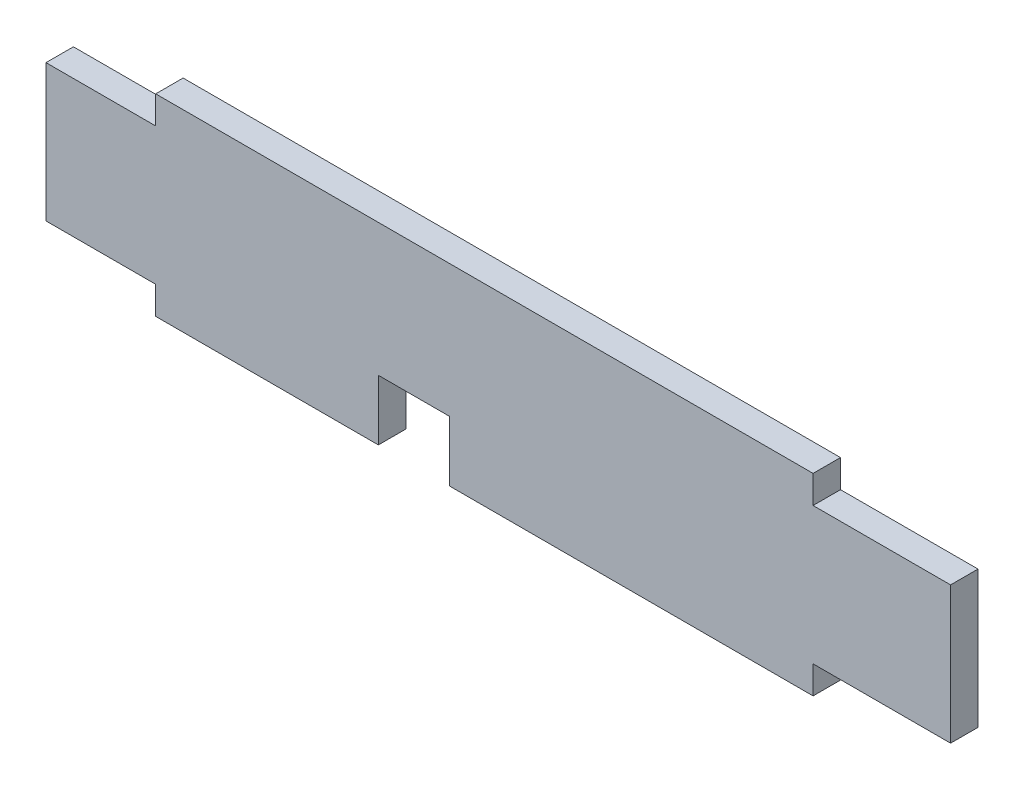
ISO-10303-21;
HEADER;
FILE_DESCRIPTION(('STEP AP214'),'2;1');
FILE_NAME('part.step','',(''),(''),'','','');
FILE_SCHEMA(('AUTOMOTIVE_DESIGN { 1 0 10303 214 1 1 1 1 }'));
ENDSEC;
DATA;
#1=APPLICATION_CONTEXT('core data for automotive mechanical design processes');
#2=APPLICATION_PROTOCOL_DEFINITION('international standard','automotive_design',2000,#1);
#3=PRODUCT_CONTEXT('',#1,'mechanical');
#4=PRODUCT('Part','Part','',(#3));
#5=PRODUCT_RELATED_PRODUCT_CATEGORY('part','',(#4));
#6=PRODUCT_DEFINITION_FORMATION('','',#4);
#7=PRODUCT_DEFINITION_CONTEXT('part definition',#1,'design');
#8=PRODUCT_DEFINITION('design','',#6,#7);
#9=PRODUCT_DEFINITION_SHAPE('','',#8);
#10=(LENGTH_UNIT() NAMED_UNIT(*) SI_UNIT(.MILLI.,.METRE.));
#11=(NAMED_UNIT(*) PLANE_ANGLE_UNIT() SI_UNIT($,.RADIAN.));
#12=(NAMED_UNIT(*) SI_UNIT($,.STERADIAN.) SOLID_ANGLE_UNIT());
#13=UNCERTAINTY_MEASURE_WITH_UNIT(LENGTH_MEASURE(1.E-05),#10,'distance_accuracy_value','');
#14=(GEOMETRIC_REPRESENTATION_CONTEXT(3) GLOBAL_UNCERTAINTY_ASSIGNED_CONTEXT((#13)) GLOBAL_UNIT_ASSIGNED_CONTEXT((#10,
#11,#12)) REPRESENTATION_CONTEXT('',''));
#15=CARTESIAN_POINT('',(0.,0.,0.));
#16=DIRECTION('',(0.,0.,1.));
#17=DIRECTION('',(1.,0.,0.));
#18=AXIS2_PLACEMENT_3D('',#15,#16,#17);
#19=CARTESIAN_POINT('',(0.,0.,5.));
#20=DIRECTION('',(0.,1.,0.));
#21=DIRECTION('',(0.,0.,1.));
#22=AXIS2_PLACEMENT_3D('',#19,#20,#21);
#23=PLANE('',#22);
#24=DIRECTION('',(1.,0.,0.));
#25=VECTOR('',#24,1.);
#26=CARTESIAN_POINT('',(0.,0.,0.));
#27=LINE('',#26,#25);
#28=CARTESIAN_POINT('',(0.,0.,0.));
#29=VERTEX_POINT('',#28);
#30=CARTESIAN_POINT('',(20.,0.,0.));
#31=VERTEX_POINT('',#30);
#32=EDGE_CURVE('E254',#29,#31,#27,.T.);
#33=ORIENTED_EDGE('',*,*,#32,.T.);
#34=DIRECTION('',(0.,0.,-1.));
#35=VECTOR('',#34,1.);
#36=CARTESIAN_POINT('',(20.,0.,5.));
#37=LINE('',#36,#35);
#38=CARTESIAN_POINT('',(20.,0.,5.));
#39=VERTEX_POINT('',#38);
#40=EDGE_CURVE('E11',#39,#31,#37,.T.);
#41=ORIENTED_EDGE('',*,*,#40,.F.);
#42=DIRECTION('',(1.,0.,0.));
#43=VECTOR('',#42,1.);
#44=CARTESIAN_POINT('',(0.,0.,5.));
#45=LINE('',#44,#43);
#46=CARTESIAN_POINT('',(0.,0.,5.));
#47=VERTEX_POINT('',#46);
#48=EDGE_CURVE('E193',#47,#39,#45,.T.);
#49=ORIENTED_EDGE('',*,*,#48,.F.);
#50=DIRECTION('',(0.,0.,-1.));
#51=VECTOR('',#50,1.);
#52=CARTESIAN_POINT('',(0.,0.,5.));
#53=LINE('',#52,#51);
#54=EDGE_CURVE('E54',#47,#29,#53,.T.);
#55=ORIENTED_EDGE('',*,*,#54,.T.);
#56=EDGE_LOOP('',(#33,#41,#49,#55));
#57=FACE_BOUND('',#56,.T.);
#58=ADVANCED_FACE('F37',(#57),#23,.F.);
#59=CARTESIAN_POINT('',(20.,0.,5.));
#60=DIRECTION('',(1.,0.,0.));
#61=DIRECTION('',(0.,0.,-1.));
#62=AXIS2_PLACEMENT_3D('',#59,#60,#61);
#63=PLANE('',#62);
#64=DIRECTION('',(0.,-1.,0.));
#65=VECTOR('',#64,1.);
#66=CARTESIAN_POINT('',(20.,0.,0.));
#67=LINE('',#66,#65);
#68=CARTESIAN_POINT('',(20.,-5.06999999999997,0.));
#69=VERTEX_POINT('',#68);
#70=EDGE_CURVE('E253',#31,#69,#67,.T.);
#71=ORIENTED_EDGE('',*,*,#70,.T.);
#72=DIRECTION('',(0.,0.,-1.));
#73=VECTOR('',#72,1.);
#74=CARTESIAN_POINT('',(20.,-5.06999999999997,5.));
#75=LINE('',#74,#73);
#76=CARTESIAN_POINT('',(20.,-5.06999999999997,5.));
#77=VERTEX_POINT('',#76);
#78=EDGE_CURVE('E46',#77,#69,#75,.T.);
#79=ORIENTED_EDGE('',*,*,#78,.F.);
#80=DIRECTION('',(0.,-1.,0.));
#81=VECTOR('',#80,1.);
#82=CARTESIAN_POINT('',(20.,0.,5.));
#83=LINE('',#82,#81);
#84=EDGE_CURVE('E116',#39,#77,#83,.T.);
#85=ORIENTED_EDGE('',*,*,#84,.F.);
#86=ORIENTED_EDGE('',*,*,#40,.T.);
#87=EDGE_LOOP('',(#71,#79,#85,#86));
#88=FACE_BOUND('',#87,.T.);
#89=ADVANCED_FACE('F39',(#88),#63,.F.);
#90=CARTESIAN_POINT('',(0.,-5.06999999999997,5.));
#91=DIRECTION('',(0.,-1.,0.));
#92=DIRECTION('',(1.,0.,0.));
#93=AXIS2_PLACEMENT_3D('',#90,#91,#92);
#94=PLANE('',#93);
#95=DIRECTION('',(-1.,0.,0.));
#96=VECTOR('',#95,1.);
#97=CARTESIAN_POINT('',(0.,-5.06999999999997,0.));
#98=LINE('',#97,#96);
#99=CARTESIAN_POINT('',(60.6,-5.06999999999998,0.));
#100=VERTEX_POINT('',#99);
#101=EDGE_CURVE('E251',#100,#69,#98,.T.);
#102=ORIENTED_EDGE('',*,*,#101,.F.);
#103=DIRECTION('',(0.,0.,-1.));
#104=VECTOR('',#103,1.);
#105=CARTESIAN_POINT('',(60.6,-5.06999999999998,5.));
#106=LINE('',#105,#104);
#107=CARTESIAN_POINT('',(60.6,-5.06999999999998,5.));
#108=VERTEX_POINT('',#107);
#109=EDGE_CURVE('E245',#108,#100,#106,.T.);
#110=ORIENTED_EDGE('',*,*,#109,.F.);
#111=DIRECTION('',(-1.,0.,0.));
#112=VECTOR('',#111,1.);
#113=CARTESIAN_POINT('',(0.,-5.06999999999997,5.));
#114=LINE('',#113,#112);
#115=EDGE_CURVE('E208',#108,#77,#114,.T.);
#116=ORIENTED_EDGE('',*,*,#115,.T.);
#117=ORIENTED_EDGE('',*,*,#78,.T.);
#118=EDGE_LOOP('',(#102,#110,#116,#117));
#119=FACE_BOUND('',#118,.T.);
#120=ADVANCED_FACE('F249',(#119),#94,.T.);
#121=CARTESIAN_POINT('',(60.6,0.,5.));
#122=DIRECTION('',(-1.,0.,0.));
#123=DIRECTION('',(0.,0.,1.));
#124=AXIS2_PLACEMENT_3D('',#121,#122,#123);
#125=PLANE('',#124);
#126=DIRECTION('',(0.,1.,0.));
#127=VECTOR('',#126,1.);
#128=CARTESIAN_POINT('',(60.6,0.,0.));
#129=LINE('',#128,#127);
#130=CARTESIAN_POINT('',(60.6,5.92999999999999,0.));
#131=VERTEX_POINT('',#130);
#132=EDGE_CURVE('E260',#100,#131,#129,.T.);
#133=ORIENTED_EDGE('',*,*,#132,.T.);
#134=DIRECTION('',(0.,0.,-1.));
#135=VECTOR('',#134,1.);
#136=CARTESIAN_POINT('',(60.6,5.92999999999999,5.));
#137=LINE('',#136,#135);
#138=CARTESIAN_POINT('',(60.6,5.92999999999999,5.));
#139=VERTEX_POINT('',#138);
#140=EDGE_CURVE('E243',#139,#131,#137,.T.);
#141=ORIENTED_EDGE('',*,*,#140,.F.);
#142=DIRECTION('',(0.,1.,0.));
#143=VECTOR('',#142,1.);
#144=CARTESIAN_POINT('',(60.6,0.,5.));
#145=LINE('',#144,#143);
#146=EDGE_CURVE('E206',#108,#139,#145,.T.);
#147=ORIENTED_EDGE('',*,*,#146,.F.);
#148=ORIENTED_EDGE('',*,*,#109,.T.);
#149=EDGE_LOOP('',(#133,#141,#147,#148));
#150=FACE_BOUND('',#149,.T.);
#151=ADVANCED_FACE('F318',(#150),#125,.F.);
#152=CARTESIAN_POINT('',(0.,5.92999999999977,5.));
#153=DIRECTION('',(0.,-1.,0.));
#154=DIRECTION('',(1.,0.,0.));
#155=AXIS2_PLACEMENT_3D('',#152,#153,#154);
#156=PLANE('',#155);
#157=DIRECTION('',(-1.,0.,0.));
#158=VECTOR('',#157,1.);
#159=CARTESIAN_POINT('',(0.,5.92999999999977,0.));
#160=LINE('',#159,#158);
#161=CARTESIAN_POINT('',(73.6,5.93000000000003,0.));
#162=VERTEX_POINT('',#161);
#163=EDGE_CURVE('E262',#162,#131,#160,.T.);
#164=ORIENTED_EDGE('',*,*,#163,.F.);
#165=DIRECTION('',(0.,0.,-1.));
#166=VECTOR('',#165,1.);
#167=CARTESIAN_POINT('',(73.6,5.93000000000003,5.));
#168=LINE('',#167,#166);
#169=CARTESIAN_POINT('',(73.6,5.93000000000003,5.));
#170=VERTEX_POINT('',#169);
#171=EDGE_CURVE('E241',#170,#162,#168,.T.);
#172=ORIENTED_EDGE('',*,*,#171,.F.);
#173=DIRECTION('',(-1.,0.,0.));
#174=VECTOR('',#173,1.);
#175=CARTESIAN_POINT('',(0.,5.92999999999977,5.));
#176=LINE('',#175,#174);
#177=EDGE_CURVE('E203',#170,#139,#176,.T.);
#178=ORIENTED_EDGE('',*,*,#177,.T.);
#179=ORIENTED_EDGE('',*,*,#140,.T.);
#180=EDGE_LOOP('',(#164,#172,#178,#179));
#181=FACE_BOUND('',#180,.T.);
#182=ADVANCED_FACE('F314',(#181),#156,.T.);
#183=CARTESIAN_POINT('',(73.6,0.,5.));
#184=DIRECTION('',(-1.,0.,0.));
#185=DIRECTION('',(0.,0.,1.));
#186=AXIS2_PLACEMENT_3D('',#183,#184,#185);
#187=PLANE('',#186);
#188=DIRECTION('',(0.,1.,0.));
#189=VECTOR('',#188,1.);
#190=CARTESIAN_POINT('',(73.6,0.,0.));
#191=LINE('',#190,#189);
#192=CARTESIAN_POINT('',(73.6,-5.06999999999998,0.));
#193=VERTEX_POINT('',#192);
#194=EDGE_CURVE('E267',#193,#162,#191,.T.);
#195=ORIENTED_EDGE('',*,*,#194,.F.);
#196=DIRECTION('',(0.,0.,-1.));
#197=VECTOR('',#196,1.);
#198=CARTESIAN_POINT('',(73.6,-5.06999999999998,5.));
#199=LINE('',#198,#197);
#200=CARTESIAN_POINT('',(73.6,-5.06999999999998,5.));
#201=VERTEX_POINT('',#200);
#202=EDGE_CURVE('E239',#201,#193,#199,.T.);
#203=ORIENTED_EDGE('',*,*,#202,.F.);
#204=DIRECTION('',(0.,1.,0.));
#205=VECTOR('',#204,1.);
#206=CARTESIAN_POINT('',(73.6,0.,5.));
#207=LINE('',#206,#205);
#208=EDGE_CURVE('E200',#201,#170,#207,.T.);
#209=ORIENTED_EDGE('',*,*,#208,.T.);
#210=ORIENTED_EDGE('',*,*,#171,.T.);
#211=EDGE_LOOP('',(#195,#203,#209,#210));
#212=FACE_BOUND('',#211,.T.);
#213=ADVANCED_FACE('F310',(#212),#187,.T.);
#214=CARTESIAN_POINT('',(0.,-5.06999999999997,5.));
#215=DIRECTION('',(0.,-1.,0.));
#216=DIRECTION('',(1.,0.,0.));
#217=AXIS2_PLACEMENT_3D('',#214,#215,#216);
#218=PLANE('',#217);
#219=DIRECTION('',(-1.,0.,0.));
#220=VECTOR('',#219,1.);
#221=CARTESIAN_POINT('',(0.,-5.06999999999997,0.));
#222=LINE('',#221,#220);
#223=CARTESIAN_POINT('',(139.86,-5.07,0.));
#224=VERTEX_POINT('',#223);
#225=EDGE_CURVE('E270',#224,#193,#222,.T.);
#226=ORIENTED_EDGE('',*,*,#225,.F.);
#227=DIRECTION('',(0.,0.,-1.));
#228=VECTOR('',#227,1.);
#229=CARTESIAN_POINT('',(139.86,-5.07,5.));
#230=LINE('',#229,#228);
#231=CARTESIAN_POINT('',(139.86,-5.07,5.));
#232=VERTEX_POINT('',#231);
#233=EDGE_CURVE('E237',#232,#224,#230,.T.);
#234=ORIENTED_EDGE('',*,*,#233,.F.);
#235=DIRECTION('',(-1.,0.,0.));
#236=VECTOR('',#235,1.);
#237=CARTESIAN_POINT('',(0.,-5.06999999999997,5.));
#238=LINE('',#237,#236);
#239=EDGE_CURVE('E197',#232,#201,#238,.T.);
#240=ORIENTED_EDGE('',*,*,#239,.T.);
#241=ORIENTED_EDGE('',*,*,#202,.T.);
#242=EDGE_LOOP('',(#226,#234,#240,#241));
#243=FACE_BOUND('',#242,.T.);
#244=ADVANCED_FACE('F306',(#243),#218,.T.);
#245=CARTESIAN_POINT('',(139.86,0.,5.));
#246=DIRECTION('',(1.,0.,0.));
#247=DIRECTION('',(0.,0.,-1.));
#248=AXIS2_PLACEMENT_3D('',#245,#246,#247);
#249=PLANE('',#248);
#250=DIRECTION('',(0.,-1.,0.));
#251=VECTOR('',#250,1.);
#252=CARTESIAN_POINT('',(139.86,0.,0.));
#253=LINE('',#252,#251);
#254=CARTESIAN_POINT('',(139.86,0.,0.));
#255=VERTEX_POINT('',#254);
#256=EDGE_CURVE('E273',#255,#224,#253,.T.);
#257=ORIENTED_EDGE('',*,*,#256,.F.);
#258=DIRECTION('',(0.,0.,-1.));
#259=VECTOR('',#258,1.);
#260=CARTESIAN_POINT('',(139.86,0.,5.));
#261=LINE('',#260,#259);
#262=CARTESIAN_POINT('',(139.86,0.,5.));
#263=VERTEX_POINT('',#262);
#264=EDGE_CURVE('E235',#263,#255,#261,.T.);
#265=ORIENTED_EDGE('',*,*,#264,.F.);
#266=DIRECTION('',(0.,-1.,0.));
#267=VECTOR('',#266,1.);
#268=CARTESIAN_POINT('',(139.86,0.,5.));
#269=LINE('',#268,#267);
#270=EDGE_CURVE('E191',#263,#232,#269,.T.);
#271=ORIENTED_EDGE('',*,*,#270,.T.);
#272=ORIENTED_EDGE('',*,*,#233,.T.);
#273=EDGE_LOOP('',(#257,#265,#271,#272));
#274=FACE_BOUND('',#273,.T.);
#275=ADVANCED_FACE('F300',(#274),#249,.T.);
#276=CARTESIAN_POINT('',(164.93,0.,0.));
#277=VERTEX_POINT('',#276);
#278=EDGE_CURVE('E276',#255,#277,#27,.T.);
#279=ORIENTED_EDGE('',*,*,#278,.T.);
#280=DIRECTION('',(0.,0.,-1.));
#281=VECTOR('',#280,1.);
#282=CARTESIAN_POINT('',(164.93,0.,5.));
#283=LINE('',#282,#281);
#284=CARTESIAN_POINT('',(164.93,0.,5.));
#285=VERTEX_POINT('',#284);
#286=EDGE_CURVE('E232',#285,#277,#283,.T.);
#287=ORIENTED_EDGE('',*,*,#286,.F.);
#288=EDGE_CURVE('E188',#263,#285,#45,.T.);
#289=ORIENTED_EDGE('',*,*,#288,.F.);
#290=ORIENTED_EDGE('',*,*,#264,.T.);
#291=EDGE_LOOP('',(#279,#287,#289,#290));
#292=FACE_BOUND('',#291,.T.);
#293=ADVANCED_FACE('F319',(#292),#23,.F.);
#294=CARTESIAN_POINT('',(164.93,0.,5.));
#295=DIRECTION('',(-1.,0.,0.));
#296=DIRECTION('',(0.,0.,1.));
#297=AXIS2_PLACEMENT_3D('',#294,#295,#296);
#298=PLANE('',#297);
#299=DIRECTION('',(0.,1.,0.));
#300=VECTOR('',#299,1.);
#301=CARTESIAN_POINT('',(164.93,0.,0.));
#302=LINE('',#301,#300);
#303=CARTESIAN_POINT('',(164.93,25.,0.));
#304=VERTEX_POINT('',#303);
#305=EDGE_CURVE('E277',#277,#304,#302,.T.);
#306=ORIENTED_EDGE('',*,*,#305,.T.);
#307=DIRECTION('',(0.,0.,-1.));
#308=VECTOR('',#307,1.);
#309=CARTESIAN_POINT('',(164.93,25.,5.));
#310=LINE('',#309,#308);
#311=CARTESIAN_POINT('',(164.93,25.,5.));
#312=VERTEX_POINT('',#311);
#313=EDGE_CURVE('E230',#312,#304,#310,.T.);
#314=ORIENTED_EDGE('',*,*,#313,.F.);
#315=DIRECTION('',(0.,1.,0.));
#316=VECTOR('',#315,1.);
#317=CARTESIAN_POINT('',(164.93,0.,5.));
#318=LINE('',#317,#316);
#319=EDGE_CURVE('E185',#285,#312,#318,.T.);
#320=ORIENTED_EDGE('',*,*,#319,.F.);
#321=ORIENTED_EDGE('',*,*,#286,.T.);
#322=EDGE_LOOP('',(#306,#314,#320,#321));
#323=FACE_BOUND('',#322,.T.);
#324=ADVANCED_FACE('F294',(#323),#298,.F.);
#325=CARTESIAN_POINT('',(0.,25.,5.));
#326=DIRECTION('',(0.,1.,0.));
#327=DIRECTION('',(0.,0.,1.));
#328=AXIS2_PLACEMENT_3D('',#325,#326,#327);
#329=PLANE('',#328);
#330=DIRECTION('',(1.,0.,0.));
#331=VECTOR('',#330,1.);
#332=CARTESIAN_POINT('',(0.,25.,0.));
#333=LINE('',#332,#331);
#334=CARTESIAN_POINT('',(139.86,25.,0.));
#335=VERTEX_POINT('',#334);
#336=EDGE_CURVE('E218',#335,#304,#333,.T.);
#337=ORIENTED_EDGE('',*,*,#336,.F.);
#338=DIRECTION('',(0.,0.,-1.));
#339=VECTOR('',#338,1.);
#340=CARTESIAN_POINT('',(139.86,25.,5.));
#341=LINE('',#340,#339);
#342=CARTESIAN_POINT('',(139.86,25.,5.));
#343=VERTEX_POINT('',#342);
#344=EDGE_CURVE('E228',#343,#335,#341,.T.);
#345=ORIENTED_EDGE('',*,*,#344,.F.);
#346=DIRECTION('',(1.,0.,0.));
#347=VECTOR('',#346,1.);
#348=CARTESIAN_POINT('',(0.,25.,5.));
#349=LINE('',#348,#347);
#350=EDGE_CURVE('E179',#343,#312,#349,.T.);
#351=ORIENTED_EDGE('',*,*,#350,.T.);
#352=ORIENTED_EDGE('',*,*,#313,.T.);
#353=EDGE_LOOP('',(#337,#345,#351,#352));
#354=FACE_BOUND('',#353,.T.);
#355=ADVANCED_FACE('F291',(#354),#329,.T.);
#356=CARTESIAN_POINT('',(139.86,0.,5.));
#357=DIRECTION('',(-1.,0.,0.));
#358=DIRECTION('',(0.,0.,1.));
#359=AXIS2_PLACEMENT_3D('',#356,#357,#358);
#360=PLANE('',#359);
#361=DIRECTION('',(0.,1.,0.));
#362=VECTOR('',#361,1.);
#363=CARTESIAN_POINT('',(139.86,0.,0.));
#364=LINE('',#363,#362);
#365=CARTESIAN_POINT('',(139.86,30.07,0.));
#366=VERTEX_POINT('',#365);
#367=EDGE_CURVE('E281',#335,#366,#364,.T.);
#368=ORIENTED_EDGE('',*,*,#367,.T.);
#369=DIRECTION('',(0.,0.,-1.));
#370=VECTOR('',#369,1.);
#371=CARTESIAN_POINT('',(139.86,30.07,5.));
#372=LINE('',#371,#370);
#373=CARTESIAN_POINT('',(139.86,30.07,5.));
#374=VERTEX_POINT('',#373);
#375=EDGE_CURVE('E225',#374,#366,#372,.T.);
#376=ORIENTED_EDGE('',*,*,#375,.F.);
#377=DIRECTION('',(0.,1.,0.));
#378=VECTOR('',#377,1.);
#379=CARTESIAN_POINT('',(139.86,0.,5.));
#380=LINE('',#379,#378);
#381=EDGE_CURVE('E184',#343,#374,#380,.T.);
#382=ORIENTED_EDGE('',*,*,#381,.F.);
#383=ORIENTED_EDGE('',*,*,#344,.T.);
#384=EDGE_LOOP('',(#368,#376,#382,#383));
#385=FACE_BOUND('',#384,.T.);
#386=ADVANCED_FACE('F349',(#385),#360,.F.);
#387=CARTESIAN_POINT('',(0.,30.07,5.));
#388=DIRECTION('',(0.,-1.,0.));
#389=DIRECTION('',(1.,0.,0.));
#390=AXIS2_PLACEMENT_3D('',#387,#388,#389);
#391=PLANE('',#390);
#392=DIRECTION('',(-1.,0.,0.));
#393=VECTOR('',#392,1.);
#394=CARTESIAN_POINT('',(0.,30.07,0.));
#395=LINE('',#394,#393);
#396=CARTESIAN_POINT('',(20.,30.07,0.));
#397=VERTEX_POINT('',#396);
#398=EDGE_CURVE('E282',#366,#397,#395,.T.);
#399=ORIENTED_EDGE('',*,*,#398,.T.);
#400=DIRECTION('',(0.,0.,-1.));
#401=VECTOR('',#400,1.);
#402=CARTESIAN_POINT('',(20.,30.07,5.));
#403=LINE('',#402,#401);
#404=CARTESIAN_POINT('',(20.,30.07,5.));
#405=VERTEX_POINT('',#404);
#406=EDGE_CURVE('E165',#405,#397,#403,.T.);
#407=ORIENTED_EDGE('',*,*,#406,.F.);
#408=DIRECTION('',(-1.,0.,0.));
#409=VECTOR('',#408,1.);
#410=CARTESIAN_POINT('',(0.,30.07,5.));
#411=LINE('',#410,#409);
#412=EDGE_CURVE('E173',#374,#405,#411,.T.);
#413=ORIENTED_EDGE('',*,*,#412,.F.);
#414=ORIENTED_EDGE('',*,*,#375,.T.);
#415=EDGE_LOOP('',(#399,#407,#413,#414));
#416=FACE_BOUND('',#415,.T.);
#417=ADVANCED_FACE('F346',(#416),#391,.F.);
#418=CARTESIAN_POINT('',(20.,0.,5.));
#419=DIRECTION('',(-1.,0.,0.));
#420=DIRECTION('',(0.,0.,1.));
#421=AXIS2_PLACEMENT_3D('',#418,#419,#420);
#422=PLANE('',#421);
#423=DIRECTION('',(0.,1.,0.));
#424=VECTOR('',#423,1.);
#425=CARTESIAN_POINT('',(20.,0.,0.));
#426=LINE('',#425,#424);
#427=CARTESIAN_POINT('',(20.,25.,0.));
#428=VERTEX_POINT('',#427);
#429=EDGE_CURVE('E161',#428,#397,#426,.T.);
#430=ORIENTED_EDGE('',*,*,#429,.F.);
#431=DIRECTION('',(0.,0.,-1.));
#432=VECTOR('',#431,1.);
#433=CARTESIAN_POINT('',(20.,25.,5.));
#434=LINE('',#433,#432);
#435=CARTESIAN_POINT('',(20.,25.,5.));
#436=VERTEX_POINT('',#435);
#437=EDGE_CURVE('E156',#436,#428,#434,.T.);
#438=ORIENTED_EDGE('',*,*,#437,.F.);
#439=DIRECTION('',(0.,1.,0.));
#440=VECTOR('',#439,1.);
#441=CARTESIAN_POINT('',(20.,0.,5.));
#442=LINE('',#441,#440);
#443=EDGE_CURVE('E159',#436,#405,#442,.T.);
#444=ORIENTED_EDGE('',*,*,#443,.T.);
#445=ORIENTED_EDGE('',*,*,#406,.T.);
#446=EDGE_LOOP('',(#430,#438,#444,#445));
#447=FACE_BOUND('',#446,.T.);
#448=ADVANCED_FACE('F158',(#447),#422,.T.);
#449=CARTESIAN_POINT('',(0.,25.,0.));
#450=VERTEX_POINT('',#449);
#451=EDGE_CURVE('E214',#450,#428,#333,.T.);
#452=ORIENTED_EDGE('',*,*,#451,.F.);
#453=DIRECTION('',(0.,0.,-1.));
#454=VECTOR('',#453,1.);
#455=CARTESIAN_POINT('',(0.,25.,5.));
#456=LINE('',#455,#454);
#457=CARTESIAN_POINT('',(0.,25.,5.));
#458=VERTEX_POINT('',#457);
#459=EDGE_CURVE('E104',#458,#450,#456,.T.);
#460=ORIENTED_EDGE('',*,*,#459,.F.);
#461=EDGE_CURVE('E171',#458,#436,#349,.T.);
#462=ORIENTED_EDGE('',*,*,#461,.T.);
#463=ORIENTED_EDGE('',*,*,#437,.T.);
#464=EDGE_LOOP('',(#452,#460,#462,#463));
#465=FACE_BOUND('',#464,.T.);
#466=ADVANCED_FACE('F176',(#465),#329,.T.);
#467=CARTESIAN_POINT('',(0.,0.,5.));
#468=DIRECTION('',(-1.,0.,0.));
#469=DIRECTION('',(0.,0.,1.));
#470=AXIS2_PLACEMENT_3D('',#467,#468,#469);
#471=PLANE('',#470);
#472=DIRECTION('',(0.,1.,0.));
#473=VECTOR('',#472,1.);
#474=CARTESIAN_POINT('',(0.,0.,0.));
#475=LINE('',#474,#473);
#476=EDGE_CURVE('E211',#29,#450,#475,.T.);
#477=ORIENTED_EDGE('',*,*,#476,.F.);
#478=ORIENTED_EDGE('',*,*,#54,.F.);
#479=DIRECTION('',(0.,1.,0.));
#480=VECTOR('',#479,1.);
#481=CARTESIAN_POINT('',(0.,0.,5.));
#482=LINE('',#481,#480);
#483=EDGE_CURVE('E177',#47,#458,#482,.T.);
#484=ORIENTED_EDGE('',*,*,#483,.T.);
#485=ORIENTED_EDGE('',*,*,#459,.T.);
#486=EDGE_LOOP('',(#477,#478,#484,#485));
#487=FACE_BOUND('',#486,.T.);
#488=ADVANCED_FACE('F333',(#487),#471,.T.);
#489=CARTESIAN_POINT('',(0.,0.,5.));
#490=DIRECTION('',(0.,0.,1.));
#491=DIRECTION('',(1.,0.,0.));
#492=AXIS2_PLACEMENT_3D('',#489,#490,#491);
#493=PLANE('',#492);
#494=ORIENTED_EDGE('',*,*,#48,.T.);
#495=ORIENTED_EDGE('',*,*,#84,.T.);
#496=ORIENTED_EDGE('',*,*,#115,.F.);
#497=ORIENTED_EDGE('',*,*,#146,.T.);
#498=ORIENTED_EDGE('',*,*,#177,.F.);
#499=ORIENTED_EDGE('',*,*,#208,.F.);
#500=ORIENTED_EDGE('',*,*,#239,.F.);
#501=ORIENTED_EDGE('',*,*,#270,.F.);
#502=ORIENTED_EDGE('',*,*,#288,.T.);
#503=ORIENTED_EDGE('',*,*,#319,.T.);
#504=ORIENTED_EDGE('',*,*,#350,.F.);
#505=ORIENTED_EDGE('',*,*,#381,.T.);
#506=ORIENTED_EDGE('',*,*,#412,.T.);
#507=ORIENTED_EDGE('',*,*,#443,.F.);
#508=ORIENTED_EDGE('',*,*,#461,.F.);
#509=ORIENTED_EDGE('',*,*,#483,.F.);
#510=EDGE_LOOP('',(#494,#495,#496,#497,#498,#499,#500,#501,#502,#503,#504,#505,#506,#507,#508,#509));
#511=FACE_BOUND('',#510,.T.);
#512=ADVANCED_FACE('F169',(#511),#493,.T.);
#513=CARTESIAN_POINT('',(0.,0.,0.));
#514=DIRECTION('',(0.,0.,1.));
#515=DIRECTION('',(1.,0.,0.));
#516=AXIS2_PLACEMENT_3D('',#513,#514,#515);
#517=PLANE('',#516);
#518=ORIENTED_EDGE('',*,*,#32,.F.);
#519=ORIENTED_EDGE('',*,*,#476,.T.);
#520=ORIENTED_EDGE('',*,*,#451,.T.);
#521=ORIENTED_EDGE('',*,*,#429,.T.);
#522=ORIENTED_EDGE('',*,*,#398,.F.);
#523=ORIENTED_EDGE('',*,*,#367,.F.);
#524=ORIENTED_EDGE('',*,*,#336,.T.);
#525=ORIENTED_EDGE('',*,*,#305,.F.);
#526=ORIENTED_EDGE('',*,*,#278,.F.);
#527=ORIENTED_EDGE('',*,*,#256,.T.);
#528=ORIENTED_EDGE('',*,*,#225,.T.);
#529=ORIENTED_EDGE('',*,*,#194,.T.);
#530=ORIENTED_EDGE('',*,*,#163,.T.);
#531=ORIENTED_EDGE('',*,*,#132,.F.);
#532=ORIENTED_EDGE('',*,*,#101,.T.);
#533=ORIENTED_EDGE('',*,*,#70,.F.);
#534=EDGE_LOOP('',(#518,#519,#520,#521,#522,#523,#524,#525,#526,#527,#528,#529,#530,#531,#532,#533));
#535=FACE_BOUND('',#534,.T.);
#536=ADVANCED_FACE('F257',(#535),#517,.F.);
#537=CLOSED_SHELL('',(#58,#89,#120,#151,#182,#213,#244,#275,#293,#324,#355,#386,#417,#448,#466,
#488,#512,#536));
#538=MANIFOLD_SOLID_BREP('B2',#537);
#539=ADVANCED_BREP_SHAPE_REPRESENTATION('',(#18,#538),#14);
#540=SHAPE_DEFINITION_REPRESENTATION(#9,#539);
ENDSEC;
END-ISO-10303-21;
